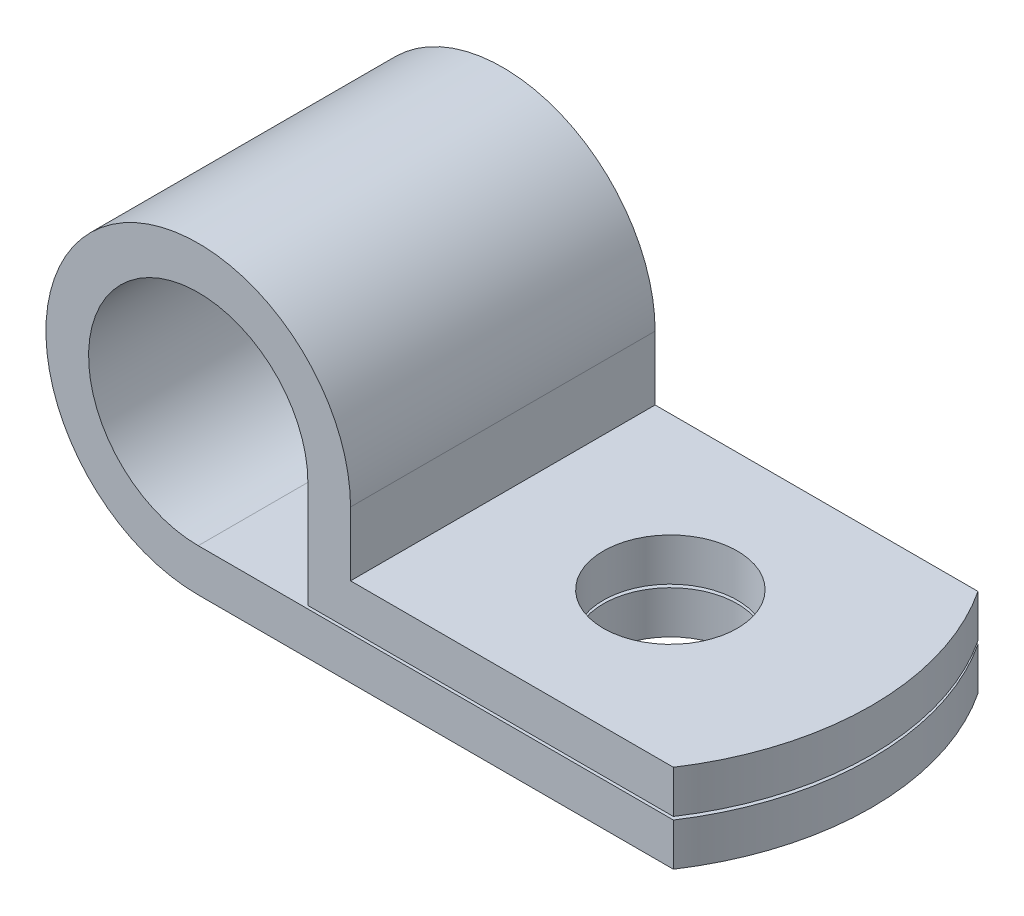
ISO-10303-21;
HEADER;
FILE_DESCRIPTION(('STEP AP214'),'2;1');
FILE_NAME('part.step','',(''),(''),'','','');
FILE_SCHEMA(('AUTOMOTIVE_DESIGN { 1 0 10303 214 1 1 1 1 }'));
ENDSEC;
DATA;
#1=APPLICATION_CONTEXT('core data for automotive mechanical design processes');
#2=APPLICATION_PROTOCOL_DEFINITION('international standard','automotive_design',2000,#1);
#3=PRODUCT_CONTEXT('',#1,'mechanical');
#4=PRODUCT('Part','Part','',(#3));
#5=PRODUCT_RELATED_PRODUCT_CATEGORY('part','',(#4));
#6=PRODUCT_DEFINITION_FORMATION('','',#4);
#7=PRODUCT_DEFINITION_CONTEXT('part definition',#1,'design');
#8=PRODUCT_DEFINITION('design','',#6,#7);
#9=PRODUCT_DEFINITION_SHAPE('','',#8);
#10=(LENGTH_UNIT() NAMED_UNIT(*) SI_UNIT(.MILLI.,.METRE.));
#11=(NAMED_UNIT(*) PLANE_ANGLE_UNIT() SI_UNIT($,.RADIAN.));
#12=(NAMED_UNIT(*) SI_UNIT($,.STERADIAN.) SOLID_ANGLE_UNIT());
#13=UNCERTAINTY_MEASURE_WITH_UNIT(LENGTH_MEASURE(1.E-05),#10,'distance_accuracy_value','');
#14=(GEOMETRIC_REPRESENTATION_CONTEXT(3) GLOBAL_UNCERTAINTY_ASSIGNED_CONTEXT((#13)) GLOBAL_UNIT_ASSIGNED_CONTEXT((#10,
#11,#12)) REPRESENTATION_CONTEXT('',''));
#15=CARTESIAN_POINT('',(0.,0.,0.));
#16=DIRECTION('',(0.,0.,1.));
#17=DIRECTION('',(1.,0.,0.));
#18=AXIS2_PLACEMENT_3D('',#15,#16,#17);
#19=CARTESIAN_POINT('',(8.016666667,-3.5,0.));
#20=DIRECTION('',(0.,1.,0.));
#21=DIRECTION('',(0.,0.,1.));
#22=AXIS2_PLACEMENT_3D('',#19,#20,#21);
#23=CYLINDRICAL_SURFACE('',#22,9.083333334);
#24=CARTESIAN_POINT('',(8.016666667,-2.1,0.));
#25=DIRECTION('',(0.,1.,0.));
#26=DIRECTION('',(0.,0.,1.));
#27=AXIS2_PLACEMENT_3D('',#24,#25,#26);
#28=CIRCLE('',#27,9.083333334);
#29=CARTESIAN_POINT('',(15.5999999998747,-2.1,-5.0000000019067));
#30=VERTEX_POINT('',#29);
#31=CARTESIAN_POINT('',(15.6000000019257,-2.09999999866,4.99999999939798));
#32=VERTEX_POINT('',#31);
#33=EDGE_CURVE('E20',#30,#32,#28,.F.);
#34=ORIENTED_EDGE('',*,*,#33,.T.);
#35=DIRECTION('',(0.,-1.,0.));
#36=VECTOR('',#35,1.);
#37=CARTESIAN_POINT('',(15.6000000027196,-2.8,4.99999999759192));
#38=LINE('',#37,#36);
#39=CARTESIAN_POINT('',(15.6000000019257,-3.5,4.99999999879596));
#40=VERTEX_POINT('',#39);
#41=EDGE_CURVE('E93',#40,#32,#38,.F.);
#42=ORIENTED_EDGE('',*,*,#41,.F.);
#43=CARTESIAN_POINT('',(8.016666667,-3.5,0.));
#44=DIRECTION('',(0.,1.,0.));
#45=DIRECTION('',(0.,0.,1.));
#46=AXIS2_PLACEMENT_3D('',#43,#44,#45);
#47=CIRCLE('',#46,9.083333334);
#48=CARTESIAN_POINT('',(15.5999999998747,-3.5,-5.0000000019067));
#49=VERTEX_POINT('',#48);
#50=EDGE_CURVE('E88',#40,#49,#47,.T.);
#51=ORIENTED_EDGE('',*,*,#50,.T.);
#52=DIRECTION('',(0.,1.,0.));
#53=VECTOR('',#52,1.);
#54=CARTESIAN_POINT('',(15.5999999986175,-2.8,-5.00000000381339));
#55=LINE('',#54,#53);
#56=EDGE_CURVE('E84',#30,#49,#55,.F.);
#57=ORIENTED_EDGE('',*,*,#56,.F.);
#58=EDGE_LOOP('',(#34,#42,#51,#57));
#59=FACE_BOUND('',#58,.T.);
#60=ADVANCED_FACE('F16',(#59),#23,.T.);
#61=CARTESIAN_POINT('',(10.5,-3.5,0.));
#62=DIRECTION('',(0.,1.,0.));
#63=DIRECTION('',(0.,0.,1.));
#64=AXIS2_PLACEMENT_3D('',#61,#62,#63);
#65=CYLINDRICAL_SURFACE('',#64,2.2);
#66=CARTESIAN_POINT('',(10.5,-3.5,0.));
#67=DIRECTION('',(0.,1.,0.));
#68=DIRECTION('',(0.,0.,1.));
#69=AXIS2_PLACEMENT_3D('',#66,#67,#68);
#70=CIRCLE('',#69,2.2);
#71=CARTESIAN_POINT('',(10.5,-3.5,2.2));
#72=VERTEX_POINT('',#71);
#73=EDGE_CURVE('E147',#72,#72,#70,.F.);
#74=ORIENTED_EDGE('',*,*,#73,.T.);
#75=EDGE_LOOP('',(#74));
#76=FACE_BOUND('',#75,.T.);
#77=CARTESIAN_POINT('',(10.5,-2.1,0.));
#78=DIRECTION('',(0.,1.,0.));
#79=DIRECTION('',(0.,0.,1.));
#80=AXIS2_PLACEMENT_3D('',#77,#78,#79);
#81=CIRCLE('',#80,2.2);
#82=CARTESIAN_POINT('',(10.5,-2.1,2.2));
#83=VERTEX_POINT('',#82);
#84=EDGE_CURVE('E102',#83,#83,#81,.T.);
#85=ORIENTED_EDGE('',*,*,#84,.T.);
#86=EDGE_LOOP('',(#85));
#87=FACE_BOUND('',#86,.T.);
#88=ADVANCED_FACE('F259',(#76,#87),#65,.F.);
#89=CARTESIAN_POINT('',(5.,-2.1,-5.));
#90=DIRECTION('',(0.,-1.,0.));
#91=DIRECTION('',(1.,0.,0.));
#92=AXIS2_PLACEMENT_3D('',#89,#90,#91);
#93=PLANE('',#92);
#94=ORIENTED_EDGE('',*,*,#84,.F.);
#95=EDGE_LOOP('',(#94));
#96=FACE_BOUND('',#95,.T.);
#97=ORIENTED_EDGE('',*,*,#33,.F.);
#98=DIRECTION('',(-1.,0.,0.));
#99=VECTOR('',#98,1.);
#100=CARTESIAN_POINT('',(5.2382,-2.09999999732,-5.));
#101=LINE('',#100,#99);
#102=CARTESIAN_POINT('',(4.99999999923253,-2.09999999821333,-5.));
#103=VERTEX_POINT('',#102);
#104=EDGE_CURVE('E99',#30,#103,#101,.T.);
#105=ORIENTED_EDGE('',*,*,#104,.T.);
#106=DIRECTION('',(0.,0.,1.));
#107=VECTOR('',#106,1.);
#108=CARTESIAN_POINT('',(5.,-2.1,0.));
#109=LINE('',#108,#107);
#110=CARTESIAN_POINT('',(4.99999999923253,-2.09999999821333,5.));
#111=VERTEX_POINT('',#110);
#112=EDGE_CURVE('E152',#103,#111,#109,.T.);
#113=ORIENTED_EDGE('',*,*,#112,.T.);
#114=DIRECTION('',(-1.,0.,0.));
#115=VECTOR('',#114,1.);
#116=CARTESIAN_POINT('',(5.2382,-2.09999999732,5.));
#117=LINE('',#116,#115);
#118=EDGE_CURVE('E101',#32,#111,#117,.T.);
#119=ORIENTED_EDGE('',*,*,#118,.F.);
#120=EDGE_LOOP('',(#97,#105,#113,#119));
#121=FACE_BOUND('',#120,.T.);
#122=ADVANCED_FACE('F97',(#96,#121),#93,.F.);
#123=CARTESIAN_POINT('',(5.,0.,-5.));
#124=DIRECTION('',(-1.,0.,0.));
#125=DIRECTION('',(0.,-1.,0.));
#126=AXIS2_PLACEMENT_3D('',#123,#124,#125);
#127=PLANE('',#126);
#128=DIRECTION('',(0.,0.,-1.));
#129=VECTOR('',#128,1.);
#130=CARTESIAN_POINT('',(5.,-2.05103428515331E-09,0.));
#131=LINE('',#130,#129);
#132=CARTESIAN_POINT('',(4.9999999994244,-1.02551757625752E-09,-5.));
#133=VERTEX_POINT('',#132);
#134=CARTESIAN_POINT('',(4.9999999994244,-1.02551714257666E-09,5.));
#135=VERTEX_POINT('',#134);
#136=EDGE_CURVE('E155',#133,#135,#131,.F.);
#137=ORIENTED_EDGE('',*,*,#136,.T.);
#138=DIRECTION('',(0.,1.,0.));
#139=VECTOR('',#138,1.);
#140=CARTESIAN_POINT('',(4.9999999988488,0.0299999999999996,5.));
#141=LINE('',#140,#139);
#142=EDGE_CURVE('E140',#111,#135,#141,.T.);
#143=ORIENTED_EDGE('',*,*,#142,.F.);
#144=ORIENTED_EDGE('',*,*,#112,.F.);
#145=DIRECTION('',(0.,1.,0.));
#146=VECTOR('',#145,1.);
#147=CARTESIAN_POINT('',(4.9999999988488,0.0299999999999996,-5.));
#148=LINE('',#147,#146);
#149=EDGE_CURVE('E106',#103,#133,#148,.T.);
#150=ORIENTED_EDGE('',*,*,#149,.T.);
#151=EDGE_LOOP('',(#137,#143,#144,#150));
#152=FACE_BOUND('',#151,.T.);
#153=ADVANCED_FACE('F227',(#152),#127,.F.);
#154=CARTESIAN_POINT('',(3.6,-3.5,5.));
#155=DIRECTION('',(1.,0.,0.));
#156=DIRECTION('',(0.,0.,-1.));
#157=AXIS2_PLACEMENT_3D('',#154,#155,#156);
#158=PLANE('',#157);
#159=DIRECTION('',(0.,0.,1.));
#160=VECTOR('',#159,1.);
#161=CARTESIAN_POINT('',(3.6,-3.5,0.));
#162=LINE('',#161,#160);
#163=CARTESIAN_POINT('',(3.6000000001304,-3.49999999861333,-5.));
#164=VERTEX_POINT('',#163);
#165=CARTESIAN_POINT('',(3.6000000001304,-3.49999999861333,5.));
#166=VERTEX_POINT('',#165);
#167=EDGE_CURVE('E150',#164,#166,#162,.T.);
#168=ORIENTED_EDGE('',*,*,#167,.T.);
#169=DIRECTION('',(0.,-1.,0.));
#170=VECTOR('',#169,1.);
#171=CARTESIAN_POINT('',(3.6000000002608,0.0299999999999996,5.));
#172=LINE('',#171,#170);
#173=CARTESIAN_POINT('',(3.6000000001304,0.,5.));
#174=VERTEX_POINT('',#173);
#175=EDGE_CURVE('E137',#174,#166,#172,.T.);
#176=ORIENTED_EDGE('',*,*,#175,.F.);
#177=DIRECTION('',(0.,0.,1.));
#178=VECTOR('',#177,1.);
#179=CARTESIAN_POINT('',(3.6,0.,0.));
#180=LINE('',#179,#178);
#181=CARTESIAN_POINT('',(3.6000000001304,0.,-5.));
#182=VERTEX_POINT('',#181);
#183=EDGE_CURVE('E160',#182,#174,#180,.T.);
#184=ORIENTED_EDGE('',*,*,#183,.F.);
#185=DIRECTION('',(0.,-1.,0.));
#186=VECTOR('',#185,1.);
#187=CARTESIAN_POINT('',(3.6000000002608,0.0299999999999996,-5.));
#188=LINE('',#187,#186);
#189=EDGE_CURVE('E111',#182,#164,#188,.T.);
#190=ORIENTED_EDGE('',*,*,#189,.T.);
#191=EDGE_LOOP('',(#168,#176,#184,#190));
#192=FACE_BOUND('',#191,.T.);
#193=ADVANCED_FACE('F203',(#192),#158,.F.);
#194=CARTESIAN_POINT('',(17.181,-3.5,-5.));
#195=DIRECTION('',(0.,1.,0.));
#196=DIRECTION('',(-1.,0.,0.));
#197=AXIS2_PLACEMENT_3D('',#194,#195,#196);
#198=PLANE('',#197);
#199=ORIENTED_EDGE('',*,*,#73,.F.);
#200=EDGE_LOOP('',(#199));
#201=FACE_BOUND('',#200,.T.);
#202=ORIENTED_EDGE('',*,*,#50,.F.);
#203=DIRECTION('',(1.,0.,0.));
#204=VECTOR('',#203,1.);
#205=CARTESIAN_POINT('',(5.2382,-3.49999999792,5.));
#206=LINE('',#205,#204);
#207=EDGE_CURVE('E187',#166,#40,#206,.T.);
#208=ORIENTED_EDGE('',*,*,#207,.F.);
#209=ORIENTED_EDGE('',*,*,#167,.F.);
#210=DIRECTION('',(1.,0.,0.));
#211=VECTOR('',#210,1.);
#212=CARTESIAN_POINT('',(5.2382,-3.49999999792,-5.));
#213=LINE('',#212,#211);
#214=EDGE_CURVE('E108',#164,#49,#213,.T.);
#215=ORIENTED_EDGE('',*,*,#214,.T.);
#216=EDGE_LOOP('',(#202,#208,#209,#215));
#217=FACE_BOUND('',#216,.T.);
#218=ADVANCED_FACE('F232',(#201,#217),#198,.F.);
#219=CARTESIAN_POINT('',(0.,0.,5.));
#220=DIRECTION('',(0.,0.,-1.));
#221=DIRECTION('',(0.,1.,0.));
#222=AXIS2_PLACEMENT_3D('',#219,#220,#221);
#223=CYLINDRICAL_SURFACE('',#222,5.);
#224=CARTESIAN_POINT('',(0.,0.,5.));
#225=DIRECTION('',(0.,0.,-1.));
#226=DIRECTION('',(0.,1.,0.));
#227=AXIS2_PLACEMENT_3D('',#224,#225,#226);
#228=CIRCLE('',#227,5.);
#229=CARTESIAN_POINT('',(0.,-5.,5.));
#230=VERTEX_POINT('',#229);
#231=EDGE_CURVE('E138',#135,#230,#228,.F.);
#232=ORIENTED_EDGE('',*,*,#231,.F.);
#233=ORIENTED_EDGE('',*,*,#136,.F.);
#234=CARTESIAN_POINT('',(0.,0.,-5.));
#235=DIRECTION('',(0.,0.,-1.));
#236=DIRECTION('',(0.,1.,0.));
#237=AXIS2_PLACEMENT_3D('',#234,#235,#236);
#238=CIRCLE('',#237,5.);
#239=CARTESIAN_POINT('',(0.,-5.,-5.));
#240=VERTEX_POINT('',#239);
#241=EDGE_CURVE('E144',#133,#240,#238,.F.);
#242=ORIENTED_EDGE('',*,*,#241,.T.);
#243=DIRECTION('',(0.,0.,1.));
#244=VECTOR('',#243,1.);
#245=CARTESIAN_POINT('',(0.,-5.,0.));
#246=LINE('',#245,#244);
#247=EDGE_CURVE('E184',#240,#230,#246,.T.);
#248=ORIENTED_EDGE('',*,*,#247,.T.);
#249=EDGE_LOOP('',(#232,#233,#242,#248));
#250=FACE_BOUND('',#249,.T.);
#251=ADVANCED_FACE('F225',(#250),#223,.T.);
#252=CARTESIAN_POINT('',(0.,0.,5.));
#253=DIRECTION('',(0.,0.,-1.));
#254=DIRECTION('',(0.,1.,0.));
#255=AXIS2_PLACEMENT_3D('',#252,#253,#254);
#256=CYLINDRICAL_SURFACE('',#255,3.6);
#257=DIRECTION('',(0.,0.,-1.));
#258=VECTOR('',#257,1.);
#259=CARTESIAN_POINT('',(0.,-3.6,0.));
#260=LINE('',#259,#258);
#261=CARTESIAN_POINT('',(0.,-3.6,5.));
#262=VERTEX_POINT('',#261);
#263=CARTESIAN_POINT('',(0.,-3.6,-5.));
#264=VERTEX_POINT('',#263);
#265=EDGE_CURVE('E174',#262,#264,#260,.T.);
#266=ORIENTED_EDGE('',*,*,#265,.T.);
#267=CARTESIAN_POINT('',(0.,0.,-5.));
#268=DIRECTION('',(0.,0.,-1.));
#269=DIRECTION('',(0.,1.,0.));
#270=AXIS2_PLACEMENT_3D('',#267,#268,#269);
#271=CIRCLE('',#270,3.6);
#272=EDGE_CURVE('E141',#264,#182,#271,.T.);
#273=ORIENTED_EDGE('',*,*,#272,.T.);
#274=ORIENTED_EDGE('',*,*,#183,.T.);
#275=CARTESIAN_POINT('',(0.,0.,5.));
#276=DIRECTION('',(0.,0.,-1.));
#277=DIRECTION('',(0.,1.,0.));
#278=AXIS2_PLACEMENT_3D('',#275,#276,#277);
#279=CIRCLE('',#278,3.6);
#280=EDGE_CURVE('E135',#262,#174,#279,.T.);
#281=ORIENTED_EDGE('',*,*,#280,.F.);
#282=EDGE_LOOP('',(#266,#273,#274,#281));
#283=FACE_BOUND('',#282,.T.);
#284=ADVANCED_FACE('F198',(#283),#256,.F.);
#285=CARTESIAN_POINT('',(-5.1236,-5.,-5.));
#286=DIRECTION('',(0.,0.,1.));
#287=DIRECTION('',(1.,0.,0.));
#288=AXIS2_PLACEMENT_3D('',#285,#286,#287);
#289=PLANE('',#288);
#290=ORIENTED_EDGE('',*,*,#56,.T.);
#291=ORIENTED_EDGE('',*,*,#214,.F.);
#292=ORIENTED_EDGE('',*,*,#189,.F.);
#293=ORIENTED_EDGE('',*,*,#272,.F.);
#294=DIRECTION('',(1.,0.,0.));
#295=VECTOR('',#294,1.);
#296=CARTESIAN_POINT('',(8.6013,-3.6,-5.));
#297=LINE('',#296,#295);
#298=CARTESIAN_POINT('',(15.5999999998747,-3.6,-5.0000000019067));
#299=VERTEX_POINT('',#298);
#300=EDGE_CURVE('E129',#264,#299,#297,.T.);
#301=ORIENTED_EDGE('',*,*,#300,.T.);
#302=DIRECTION('',(0.,1.,0.));
#303=VECTOR('',#302,1.);
#304=CARTESIAN_POINT('',(15.5999999986175,-4.3,-5.00000000381339));
#305=LINE('',#304,#303);
#306=CARTESIAN_POINT('',(15.5999999998747,-5.,-5.0000000019067));
#307=VERTEX_POINT('',#306);
#308=EDGE_CURVE('E107',#299,#307,#305,.F.);
#309=ORIENTED_EDGE('',*,*,#308,.T.);
#310=DIRECTION('',(-1.,0.,0.));
#311=VECTOR('',#310,1.);
#312=CARTESIAN_POINT('',(8.6013,-5.,-5.));
#313=LINE('',#312,#311);
#314=EDGE_CURVE('E133',#307,#240,#313,.T.);
#315=ORIENTED_EDGE('',*,*,#314,.T.);
#316=ORIENTED_EDGE('',*,*,#241,.F.);
#317=ORIENTED_EDGE('',*,*,#149,.F.);
#318=ORIENTED_EDGE('',*,*,#104,.F.);
#319=EDGE_LOOP('',(#290,#291,#292,#293,#301,#309,#315,#316,#317,#318));
#320=FACE_BOUND('',#319,.T.);
#321=ADVANCED_FACE('F104',(#320),#289,.F.);
#322=CARTESIAN_POINT('',(8.016666667,-5.,0.));
#323=DIRECTION('',(0.,1.,0.));
#324=DIRECTION('',(0.,0.,1.));
#325=AXIS2_PLACEMENT_3D('',#322,#323,#324);
#326=CYLINDRICAL_SURFACE('',#325,9.083333334);
#327=CARTESIAN_POINT('',(8.016666667,-3.6,0.));
#328=DIRECTION('',(0.,1.,0.));
#329=DIRECTION('',(0.,0.,1.));
#330=AXIS2_PLACEMENT_3D('',#327,#328,#329);
#331=CIRCLE('',#330,9.083333334);
#332=CARTESIAN_POINT('',(15.6000000005659,-3.6,5.));
#333=VERTEX_POINT('',#332);
#334=EDGE_CURVE('E126',#299,#333,#331,.F.);
#335=ORIENTED_EDGE('',*,*,#334,.T.);
#336=DIRECTION('',(0.,1.,0.));
#337=VECTOR('',#336,1.);
#338=CARTESIAN_POINT('',(15.6,0.0299999999999996,5.));
#339=LINE('',#338,#337);
#340=CARTESIAN_POINT('',(15.6000000005659,-5.,5.));
#341=VERTEX_POINT('',#340);
#342=EDGE_CURVE('E35',#341,#333,#339,.T.);
#343=ORIENTED_EDGE('',*,*,#342,.F.);
#344=CARTESIAN_POINT('',(8.016666667,-5.,0.));
#345=DIRECTION('',(0.,1.,0.));
#346=DIRECTION('',(0.,0.,1.));
#347=AXIS2_PLACEMENT_3D('',#344,#345,#346);
#348=CIRCLE('',#347,9.083333334);
#349=EDGE_CURVE('E130',#341,#307,#348,.T.);
#350=ORIENTED_EDGE('',*,*,#349,.T.);
#351=ORIENTED_EDGE('',*,*,#308,.F.);
#352=EDGE_LOOP('',(#335,#343,#350,#351));
#353=FACE_BOUND('',#352,.T.);
#354=ADVANCED_FACE('F217',(#353),#326,.T.);
#355=CARTESIAN_POINT('',(-5.1236,-5.,5.));
#356=DIRECTION('',(0.,0.,1.));
#357=DIRECTION('',(1.,0.,0.));
#358=AXIS2_PLACEMENT_3D('',#355,#356,#357);
#359=PLANE('',#358);
#360=ORIENTED_EDGE('',*,*,#175,.T.);
#361=ORIENTED_EDGE('',*,*,#207,.T.);
#362=ORIENTED_EDGE('',*,*,#41,.T.);
#363=ORIENTED_EDGE('',*,*,#118,.T.);
#364=ORIENTED_EDGE('',*,*,#142,.T.);
#365=ORIENTED_EDGE('',*,*,#231,.T.);
#366=DIRECTION('',(1.,0.,0.));
#367=VECTOR('',#366,1.);
#368=CARTESIAN_POINT('',(8.6013,-5.,5.));
#369=LINE('',#368,#367);
#370=EDGE_CURVE('E134',#230,#341,#369,.T.);
#371=ORIENTED_EDGE('',*,*,#370,.T.);
#372=ORIENTED_EDGE('',*,*,#342,.T.);
#373=DIRECTION('',(-1.,0.,0.));
#374=VECTOR('',#373,1.);
#375=CARTESIAN_POINT('',(8.6013,-3.6,5.));
#376=LINE('',#375,#374);
#377=EDGE_CURVE('E125',#333,#262,#376,.T.);
#378=ORIENTED_EDGE('',*,*,#377,.T.);
#379=ORIENTED_EDGE('',*,*,#280,.T.);
#380=EDGE_LOOP('',(#360,#361,#362,#363,#364,#365,#371,#372,#378,#379));
#381=FACE_BOUND('',#380,.T.);
#382=ADVANCED_FACE('F212',(#381),#359,.T.);
#383=CARTESIAN_POINT('',(0.,-5.,-5.));
#384=DIRECTION('',(0.,1.,0.));
#385=DIRECTION('',(0.,0.,1.));
#386=AXIS2_PLACEMENT_3D('',#383,#384,#385);
#387=PLANE('',#386);
#388=CARTESIAN_POINT('',(10.5,-5.,0.));
#389=DIRECTION('',(0.,1.,0.));
#390=DIRECTION('',(0.,0.,1.));
#391=AXIS2_PLACEMENT_3D('',#388,#389,#390);
#392=CIRCLE('',#391,2.2);
#393=CARTESIAN_POINT('',(10.5,-5.,2.2));
#394=VERTEX_POINT('',#393);
#395=EDGE_CURVE('E26',#394,#394,#392,.F.);
#396=ORIENTED_EDGE('',*,*,#395,.F.);
#397=EDGE_LOOP('',(#396));
#398=FACE_BOUND('',#397,.T.);
#399=ORIENTED_EDGE('',*,*,#349,.F.);
#400=ORIENTED_EDGE('',*,*,#370,.F.);
#401=ORIENTED_EDGE('',*,*,#247,.F.);
#402=ORIENTED_EDGE('',*,*,#314,.F.);
#403=EDGE_LOOP('',(#399,#400,#401,#402));
#404=FACE_BOUND('',#403,.T.);
#405=ADVANCED_FACE('F221',(#398,#404),#387,.F.);
#406=CARTESIAN_POINT('',(0.,-3.6,-5.));
#407=DIRECTION('',(0.,-1.,0.));
#408=DIRECTION('',(1.,0.,0.));
#409=AXIS2_PLACEMENT_3D('',#406,#407,#408);
#410=PLANE('',#409);
#411=CARTESIAN_POINT('',(10.5,-3.6,0.));
#412=DIRECTION('',(0.,1.,0.));
#413=DIRECTION('',(0.,0.,1.));
#414=AXIS2_PLACEMENT_3D('',#411,#412,#413);
#415=CIRCLE('',#414,2.2);
#416=CARTESIAN_POINT('',(10.5,-3.6,2.2));
#417=VERTEX_POINT('',#416);
#418=EDGE_CURVE('E11',#417,#417,#415,.T.);
#419=ORIENTED_EDGE('',*,*,#418,.F.);
#420=EDGE_LOOP('',(#419));
#421=FACE_BOUND('',#420,.T.);
#422=ORIENTED_EDGE('',*,*,#334,.F.);
#423=ORIENTED_EDGE('',*,*,#300,.F.);
#424=ORIENTED_EDGE('',*,*,#265,.F.);
#425=ORIENTED_EDGE('',*,*,#377,.F.);
#426=EDGE_LOOP('',(#422,#423,#424,#425));
#427=FACE_BOUND('',#426,.T.);
#428=ADVANCED_FACE('F18',(#421,#427),#410,.F.);
#429=CARTESIAN_POINT('',(10.5,-5.,0.));
#430=DIRECTION('',(0.,1.,0.));
#431=DIRECTION('',(0.,0.,1.));
#432=AXIS2_PLACEMENT_3D('',#429,#430,#431);
#433=CYLINDRICAL_SURFACE('',#432,2.2);
#434=ORIENTED_EDGE('',*,*,#395,.T.);
#435=EDGE_LOOP('',(#434));
#436=FACE_BOUND('',#435,.T.);
#437=ORIENTED_EDGE('',*,*,#418,.T.);
#438=EDGE_LOOP('',(#437));
#439=FACE_BOUND('',#438,.T.);
#440=ADVANCED_FACE('F245',(#436,#439),#433,.F.);
#441=CLOSED_SHELL('',(#60,#88,#122,#153,#193,#218,#251,#284,#321,#354,#382,#405,#428,#440));
#442=MANIFOLD_SOLID_BREP('B1',#441);
#443=ADVANCED_BREP_SHAPE_REPRESENTATION('',(#18,#442),#14);
#444=SHAPE_DEFINITION_REPRESENTATION(#9,#443);
ENDSEC;
END-ISO-10303-21;
